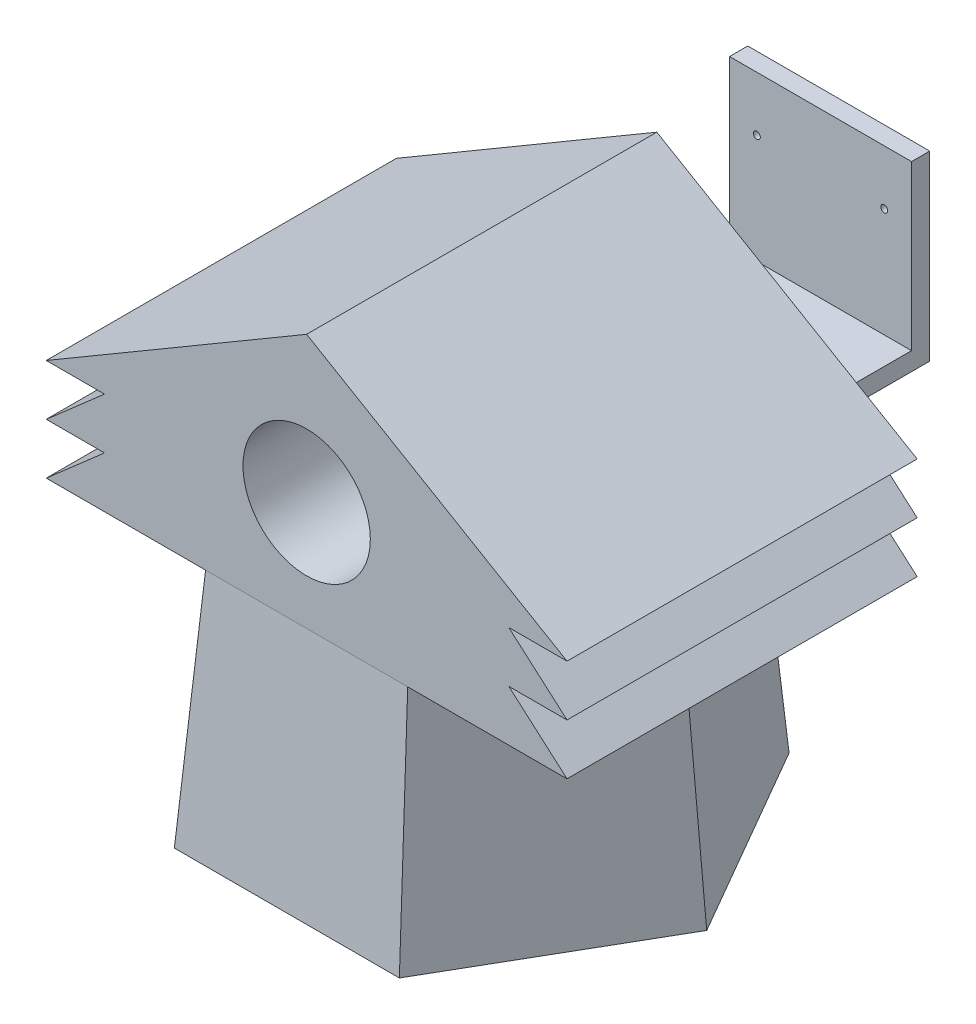
ISO-10303-21;
HEADER;
FILE_DESCRIPTION(('STEP AP214'),'2;1');
FILE_NAME('part.step','',(''),(''),'','','');
FILE_SCHEMA(('AUTOMOTIVE_DESIGN { 1 0 10303 214 1 1 1 1 }'));
ENDSEC;
DATA;
#1=APPLICATION_CONTEXT('core data for automotive mechanical design processes');
#2=APPLICATION_PROTOCOL_DEFINITION('international standard','automotive_design',2000,#1);
#3=PRODUCT_CONTEXT('',#1,'mechanical');
#4=PRODUCT('Part','Part','',(#3));
#5=PRODUCT_RELATED_PRODUCT_CATEGORY('part','',(#4));
#6=PRODUCT_DEFINITION_FORMATION('','',#4);
#7=PRODUCT_DEFINITION_CONTEXT('part definition',#1,'design');
#8=PRODUCT_DEFINITION('design','',#6,#7);
#9=PRODUCT_DEFINITION_SHAPE('','',#8);
#10=(LENGTH_UNIT() NAMED_UNIT(*) SI_UNIT(.MILLI.,.METRE.));
#11=(NAMED_UNIT(*) PLANE_ANGLE_UNIT() SI_UNIT($,.RADIAN.));
#12=(NAMED_UNIT(*) SI_UNIT($,.STERADIAN.) SOLID_ANGLE_UNIT());
#13=UNCERTAINTY_MEASURE_WITH_UNIT(LENGTH_MEASURE(1.E-05),#10,'distance_accuracy_value','');
#14=(GEOMETRIC_REPRESENTATION_CONTEXT(3) GLOBAL_UNCERTAINTY_ASSIGNED_CONTEXT((#13)) GLOBAL_UNIT_ASSIGNED_CONTEXT((#10,
#11,#12)) REPRESENTATION_CONTEXT('',''));
#15=CARTESIAN_POINT('',(0.,0.,0.));
#16=DIRECTION('',(0.,0.,1.));
#17=DIRECTION('',(1.,0.,0.));
#18=AXIS2_PLACEMENT_3D('',#15,#16,#17);
#19=CARTESIAN_POINT('',(0.,265.,0.));
#20=DIRECTION('',(0.,-1.,0.));
#21=DIRECTION('',(0.,0.,-1.));
#22=AXIS2_PLACEMENT_3D('',#19,#20,#21);
#23=PLANE('',#22);
#24=DIRECTION('',(-0.5,0.,0.866025403784439));
#25=VECTOR('',#24,1.);
#26=CARTESIAN_POINT('',(34.7077525117772,265.,20.0385302556415));
#27=LINE('',#26,#25);
#28=CARTESIAN_POINT('',(46.2770033490363,265.,-1.54114276739265E-13));
#29=VERTEX_POINT('',#28);
#30=CARTESIAN_POINT('',(23.1385016745183,265.,40.0770605112829));
#31=VERTEX_POINT('',#30);
#32=EDGE_CURVE('E457',#29,#31,#27,.T.);
#33=ORIENTED_EDGE('',*,*,#32,.T.);
#34=DIRECTION('',(-1.,0.,0.));
#35=VECTOR('',#34,1.);
#36=CARTESIAN_POINT('',(0.,265.,40.0770605112829));
#37=LINE('',#36,#35);
#38=CARTESIAN_POINT('',(-23.138501674518,265.,40.0770605112831));
#39=VERTEX_POINT('',#38);
#40=EDGE_CURVE('E471',#31,#39,#37,.T.);
#41=ORIENTED_EDGE('',*,*,#40,.T.);
#42=DIRECTION('',(-0.5,0.,-0.866025403784438));
#43=VECTOR('',#42,1.);
#44=CARTESIAN_POINT('',(-34.7077525117772,265.,20.0385302556415));
#45=LINE('',#44,#43);
#46=CARTESIAN_POINT('',(-46.2770033490363,265.,1.96695190585927E-13));
#47=VERTEX_POINT('',#46);
#48=EDGE_CURVE('E470',#39,#47,#45,.T.);
#49=ORIENTED_EDGE('',*,*,#48,.T.);
#50=DIRECTION('',(0.5,0.,-0.866025403784439));
#51=VECTOR('',#50,1.);
#52=CARTESIAN_POINT('',(-34.7077525117772,265.,-20.0385302556414));
#53=LINE('',#52,#51);
#54=CARTESIAN_POINT('',(-23.1385016745182,265.,-40.0770605112829));
#55=VERTEX_POINT('',#54);
#56=EDGE_CURVE('E379',#47,#55,#53,.T.);
#57=ORIENTED_EDGE('',*,*,#56,.T.);
#58=DIRECTION('',(1.,0.,0.));
#59=VECTOR('',#58,1.);
#60=CARTESIAN_POINT('',(0.,265.,-40.0770605112829));
#61=LINE('',#60,#59);
#62=CARTESIAN_POINT('',(23.138501674518,265.,-40.077060511283));
#63=VERTEX_POINT('',#62);
#64=EDGE_CURVE('E447',#55,#63,#61,.T.);
#65=ORIENTED_EDGE('',*,*,#64,.T.);
#66=DIRECTION('',(0.5,0.,0.866025403784438));
#67=VECTOR('',#66,1.);
#68=CARTESIAN_POINT('',(34.7077525117772,265.,-20.0385302556415));
#69=LINE('',#68,#67);
#70=EDGE_CURVE('E451',#63,#29,#69,.T.);
#71=ORIENTED_EDGE('',*,*,#70,.T.);
#72=EDGE_LOOP('',(#33,#41,#49,#57,#65,#71));
#73=FACE_BOUND('',#72,.T.);
#74=ADVANCED_FACE('F170',(#73),#23,.T.);
#75=CARTESIAN_POINT('',(-53.5265211183675,5.16901772803462,-30.9035513764736));
#76=DIRECTION('',(0.863012612721963,-0.08334050862025,0.498260564269067));
#77=DIRECTION('',(0.5,0.,-0.866025403784439));
#78=AXIS2_PLACEMENT_3D('',#75,#76,#77);
#79=PLANE('',#78);
#80=DIRECTION('',(-0.5,0.,0.866025403784439));
#81=VECTOR('',#80,1.);
#82=CARTESIAN_POINT('',(-39.4155050235543,200.,-22.7565524355941));
#83=LINE('',#82,#81);
#84=CARTESIAN_POINT('',(-26.2770033490365,200.,-45.5131048711882));
#85=VERTEX_POINT('',#84);
#86=CARTESIAN_POINT('',(-52.5540066980726,200.,3.90519791167494E-13));
#87=VERTEX_POINT('',#86);
#88=EDGE_CURVE('E12',#85,#87,#83,.T.);
#89=ORIENTED_EDGE('',*,*,#88,.F.);
#90=DIRECTION('',(0.0480610614431202,0.995369548204004,0.0832442002851681));
#91=VECTOR('',#90,1.);
#92=CARTESIAN_POINT('',(-30.3811978464837,115.,-52.6217782649107));
#93=LINE('',#92,#91);
#94=EDGE_CURVE('E381',#85,#55,#93,.T.);
#95=ORIENTED_EDGE('',*,*,#94,.T.);
#96=ORIENTED_EDGE('',*,*,#56,.F.);
#97=DIRECTION('',(0.0961221228862355,0.995369548204004,0.));
#98=VECTOR('',#97,1.);
#99=CARTESIAN_POINT('',(-60.7623956929663,115.,6.45317133063372E-13));
#100=LINE('',#99,#98);
#101=EDGE_CURVE('E371',#87,#47,#100,.T.);
#102=ORIENTED_EDGE('',*,*,#101,.F.);
#103=EDGE_LOOP('',(#89,#95,#96,#102));
#104=FACE_BOUND('',#103,.T.);
#105=ADVANCED_FACE('F377',(#104),#79,.T.);
#106=CARTESIAN_POINT('',(0.,5.16901772803463,-61.8071027529474));
#107=DIRECTION('',(0.,-0.0833405086202501,0.996521128538135));
#108=DIRECTION('',(0.,-0.996521128538135,-0.0833405086202501));
#109=AXIS2_PLACEMENT_3D('',#106,#107,#108);
#110=PLANE('',#109);
#111=DIRECTION('',(-1.,0.,0.));
#112=VECTOR('',#111,1.);
#113=CARTESIAN_POINT('',(0.,200.,-45.5131048711883));
#114=LINE('',#113,#112);
#115=CARTESIAN_POINT('',(26.277003349036,200.,-45.5131048711885));
#116=VERTEX_POINT('',#115);
#117=EDGE_CURVE('E195',#116,#85,#114,.T.);
#118=ORIENTED_EDGE('',*,*,#117,.F.);
#119=DIRECTION('',(-0.0480610614431154,0.995369548204004,0.0832442002851709));
#120=VECTOR('',#119,1.);
#121=CARTESIAN_POINT('',(30.3811978464826,115.,-52.6217782649113));
#122=LINE('',#121,#120);
#123=EDGE_CURVE('E384',#116,#63,#122,.T.);
#124=ORIENTED_EDGE('',*,*,#123,.T.);
#125=ORIENTED_EDGE('',*,*,#64,.F.);
#126=ORIENTED_EDGE('',*,*,#94,.F.);
#127=EDGE_LOOP('',(#118,#124,#125,#126));
#128=FACE_BOUND('',#127,.T.);
#129=ADVANCED_FACE('F445',(#128),#110,.T.);
#130=CARTESIAN_POINT('',(53.5265211183675,5.16901772803463,-30.9035513764737));
#131=DIRECTION('',(-0.863012612721963,-0.0833405086202501,0.498260564269068));
#132=DIRECTION('',(0.5,0.,0.866025403784438));
#133=AXIS2_PLACEMENT_3D('',#130,#131,#132);
#134=PLANE('',#133);
#135=DIRECTION('',(-0.5,0.,-0.866025403784438));
#136=VECTOR('',#135,1.);
#137=CARTESIAN_POINT('',(39.4155050235543,200.,-22.7565524355942));
#138=LINE('',#137,#136);
#139=CARTESIAN_POINT('',(52.5540066980725,200.,-2.95675747812406E-13));
#140=VERTEX_POINT('',#139);
#141=EDGE_CURVE('E953',#140,#116,#138,.T.);
#142=ORIENTED_EDGE('',*,*,#141,.F.);
#143=DIRECTION('',(-0.0961221228862355,0.995369548204004,0.));
#144=VECTOR('',#143,1.);
#145=CARTESIAN_POINT('',(60.7623956929663,115.,-6.34393653578018E-13));
#146=LINE('',#145,#144);
#147=EDGE_CURVE('E439',#140,#29,#146,.T.);
#148=ORIENTED_EDGE('',*,*,#147,.T.);
#149=ORIENTED_EDGE('',*,*,#70,.F.);
#150=ORIENTED_EDGE('',*,*,#123,.F.);
#151=EDGE_LOOP('',(#142,#148,#149,#150));
#152=FACE_BOUND('',#151,.T.);
#153=ADVANCED_FACE('F452',(#152),#134,.T.);
#154=CARTESIAN_POINT('',(53.5265211183675,5.16901772803463,30.9035513764737));
#155=DIRECTION('',(-0.863012612721963,-0.0833405086202501,-0.498260564269067));
#156=DIRECTION('',(-0.5,0.,0.866025403784439));
#157=AXIS2_PLACEMENT_3D('',#154,#155,#156);
#158=PLANE('',#157);
#159=DIRECTION('',(0.5,0.,-0.866025403784439));
#160=VECTOR('',#159,1.);
#161=CARTESIAN_POINT('',(39.4155050235544,200.,22.7565524355941));
#162=LINE('',#161,#160);
#163=CARTESIAN_POINT('',(26.2770033490365,200.,45.5131048711882));
#164=VERTEX_POINT('',#163);
#165=EDGE_CURVE('E375',#164,#140,#162,.T.);
#166=ORIENTED_EDGE('',*,*,#165,.F.);
#167=DIRECTION('',(-0.0480610614431203,0.995369548204004,-0.0832442002851682));
#168=VECTOR('',#167,1.);
#169=CARTESIAN_POINT('',(30.3811978464837,115.,52.6217782649107));
#170=LINE('',#169,#168);
#171=EDGE_CURVE('E405',#164,#31,#170,.T.);
#172=ORIENTED_EDGE('',*,*,#171,.T.);
#173=ORIENTED_EDGE('',*,*,#32,.F.);
#174=ORIENTED_EDGE('',*,*,#147,.F.);
#175=EDGE_LOOP('',(#166,#172,#173,#174));
#176=FACE_BOUND('',#175,.T.);
#177=ADVANCED_FACE('F738',(#176),#158,.T.);
#178=CARTESIAN_POINT('',(-53.5265211183675,5.16901772803463,30.9035513764737));
#179=DIRECTION('',(0.863012612721963,-0.0833405086202502,-0.498260564269068));
#180=DIRECTION('',(-0.5,0.,-0.866025403784438));
#181=AXIS2_PLACEMENT_3D('',#178,#179,#180);
#182=PLANE('',#181);
#183=DIRECTION('',(0.5,0.,0.866025403784438));
#184=VECTOR('',#183,1.);
#185=CARTESIAN_POINT('',(-39.4155050235543,200.,22.7565524355942));
#186=LINE('',#185,#184);
#187=CARTESIAN_POINT('',(-26.277003349036,200.,45.5131048711887));
#188=VERTEX_POINT('',#187);
#189=EDGE_CURVE('E362',#87,#188,#186,.T.);
#190=ORIENTED_EDGE('',*,*,#189,.F.);
#191=ORIENTED_EDGE('',*,*,#101,.T.);
#192=ORIENTED_EDGE('',*,*,#48,.F.);
#193=DIRECTION('',(0.0480610614431152,0.995369548204004,-0.0832442002851711));
#194=VECTOR('',#193,1.);
#195=CARTESIAN_POINT('',(-30.3811978464826,115.,52.6217782649113));
#196=LINE('',#195,#194);
#197=EDGE_CURVE('E373',#188,#39,#196,.T.);
#198=ORIENTED_EDGE('',*,*,#197,.F.);
#199=EDGE_LOOP('',(#190,#191,#192,#198));
#200=FACE_BOUND('',#199,.T.);
#201=ADVANCED_FACE('F369',(#200),#182,.T.);
#202=CARTESIAN_POINT('',(0.,5.16901772803463,61.8071027529474));
#203=DIRECTION('',(0.,-0.0833405086202502,-0.996521128538135));
#204=DIRECTION('',(0.,0.996521128538135,-0.0833405086202502));
#205=AXIS2_PLACEMENT_3D('',#202,#203,#204);
#206=PLANE('',#205);
#207=DIRECTION('',(1.,0.,0.));
#208=VECTOR('',#207,1.);
#209=CARTESIAN_POINT('',(0.,200.,45.5131048711883));
#210=LINE('',#209,#208);
#211=EDGE_CURVE('E374',#188,#164,#210,.T.);
#212=ORIENTED_EDGE('',*,*,#211,.F.);
#213=ORIENTED_EDGE('',*,*,#197,.T.);
#214=ORIENTED_EDGE('',*,*,#40,.F.);
#215=ORIENTED_EDGE('',*,*,#171,.F.);
#216=EDGE_LOOP('',(#212,#213,#214,#215));
#217=FACE_BOUND('',#216,.T.);
#218=ADVANCED_FACE('F744',(#217),#206,.T.);
#219=CARTESIAN_POINT('',(-101.551779300102,200.,-98.1049886413525));
#220=DIRECTION('',(0.,1.,0.));
#221=DIRECTION('',(0.,0.,1.));
#222=AXIS2_PLACEMENT_3D('',#219,#220,#221);
#223=PLANE('',#222);
#224=ORIENTED_EDGE('',*,*,#211,.T.);
#225=ORIENTED_EDGE('',*,*,#165,.T.);
#226=ORIENTED_EDGE('',*,*,#141,.T.);
#227=ORIENTED_EDGE('',*,*,#117,.T.);
#228=ORIENTED_EDGE('',*,*,#88,.T.);
#229=ORIENTED_EDGE('',*,*,#189,.T.);
#230=EDGE_LOOP('',(#224,#225,#226,#227,#228,#229));
#231=FACE_BOUND('',#230,.T.);
#232=DIRECTION('',(0.5,0.,0.866025403784438));
#233=VECTOR('',#232,1.);
#234=CARTESIAN_POINT('',(-46.3678947239503,200.,26.770516500629));
#235=LINE('',#234,#233);
#236=CARTESIAN_POINT('',(-61.8238596319338,200.,0.));
#237=VERTEX_POINT('',#236);
#238=CARTESIAN_POINT('',(-30.9119298159669,200.,53.5410330012579));
#239=VERTEX_POINT('',#238);
#240=EDGE_CURVE('E188',#237,#239,#235,.T.);
#241=ORIENTED_EDGE('',*,*,#240,.F.);
#242=DIRECTION('',(-0.5,0.,0.866025403784439));
#243=VECTOR('',#242,1.);
#244=CARTESIAN_POINT('',(-46.3678947239503,200.,-26.7705165006289));
#245=LINE('',#244,#243);
#246=CARTESIAN_POINT('',(-30.9119298159669,200.,-53.5410330012579));
#247=VERTEX_POINT('',#246);
#248=EDGE_CURVE('E630',#247,#237,#245,.T.);
#249=ORIENTED_EDGE('',*,*,#248,.F.);
#250=DIRECTION('',(-1.,0.,0.));
#251=VECTOR('',#250,1.);
#252=CARTESIAN_POINT('',(0.,200.,-53.5410330012579));
#253=LINE('',#252,#251);
#254=CARTESIAN_POINT('',(30.9119298159669,200.,-53.5410330012579));
#255=VERTEX_POINT('',#254);
#256=EDGE_CURVE('E629',#255,#247,#253,.T.);
#257=ORIENTED_EDGE('',*,*,#256,.F.);
#258=DIRECTION('',(-0.5,0.,-0.866025403784438));
#259=VECTOR('',#258,1.);
#260=CARTESIAN_POINT('',(46.3678947239503,200.,-26.770516500629));
#261=LINE('',#260,#259);
#262=CARTESIAN_POINT('',(61.8238596319338,200.,0.));
#263=VERTEX_POINT('',#262);
#264=EDGE_CURVE('E621',#263,#255,#261,.T.);
#265=ORIENTED_EDGE('',*,*,#264,.F.);
#266=DIRECTION('',(0.5,0.,-0.866025403784439));
#267=VECTOR('',#266,1.);
#268=CARTESIAN_POINT('',(46.3678947239503,200.,26.770516500629));
#269=LINE('',#268,#267);
#270=CARTESIAN_POINT('',(30.9119298159669,200.,53.5410330012579));
#271=VERTEX_POINT('',#270);
#272=EDGE_CURVE('E636',#271,#263,#269,.T.);
#273=ORIENTED_EDGE('',*,*,#272,.F.);
#274=DIRECTION('',(1.,0.,0.));
#275=VECTOR('',#274,1.);
#276=CARTESIAN_POINT('',(0.,200.,53.5410330012579));
#277=LINE('',#276,#275);
#278=EDGE_CURVE('E639',#239,#271,#277,.T.);
#279=ORIENTED_EDGE('',*,*,#278,.F.);
#280=EDGE_LOOP('',(#241,#249,#257,#265,#273,#279));
#281=FACE_BOUND('',#280,.T.);
#282=ADVANCED_FACE('F361',(#231,#281),#223,.F.);
#283=CARTESIAN_POINT('',(25.,273.,-98.1049886413525));
#284=DIRECTION('',(0.,-1.,0.));
#285=DIRECTION('',(0.,0.,-1.));
#286=AXIS2_PLACEMENT_3D('',#283,#284,#285);
#287=PLANE('',#286);
#288=DIRECTION('',(1.,0.,0.));
#289=VECTOR('',#288,1.);
#290=CARTESIAN_POINT('',(25.,273.,-93.1049886413525));
#291=LINE('',#290,#289);
#292=CARTESIAN_POINT('',(-25.,273.,-93.1049886413525));
#293=VERTEX_POINT('',#292);
#294=CARTESIAN_POINT('',(25.,273.,-93.1049886413525));
#295=VERTEX_POINT('',#294);
#296=EDGE_CURVE('E641',#293,#295,#291,.T.);
#297=ORIENTED_EDGE('',*,*,#296,.F.);
#298=DIRECTION('',(0.,0.,1.));
#299=VECTOR('',#298,1.);
#300=CARTESIAN_POINT('',(-25.,273.,-98.1049886413525));
#301=LINE('',#300,#299);
#302=CARTESIAN_POINT('',(-25.,273.,-48.1049886413525));
#303=VERTEX_POINT('',#302);
#304=EDGE_CURVE('E679',#293,#303,#301,.T.);
#305=ORIENTED_EDGE('',*,*,#304,.T.);
#306=DIRECTION('',(1.,0.,0.));
#307=VECTOR('',#306,1.);
#308=CARTESIAN_POINT('',(25.,273.,-48.1049886413525));
#309=LINE('',#308,#307);
#310=CARTESIAN_POINT('',(25.,273.,-48.1049886413525));
#311=VERTEX_POINT('',#310);
#312=EDGE_CURVE('E663',#303,#311,#309,.T.);
#313=ORIENTED_EDGE('',*,*,#312,.T.);
#314=DIRECTION('',(0.,0.,1.));
#315=VECTOR('',#314,1.);
#316=CARTESIAN_POINT('',(25.,273.,-98.1049886413525));
#317=LINE('',#316,#315);
#318=EDGE_CURVE('E667',#295,#311,#317,.T.);
#319=ORIENTED_EDGE('',*,*,#318,.F.);
#320=EDGE_LOOP('',(#297,#305,#313,#319));
#321=FACE_BOUND('',#320,.T.);
#322=ADVANCED_FACE('F749',(#321),#287,.F.);
#323=CARTESIAN_POINT('',(71.5468562828976,335.,-48.1049886413525));
#324=DIRECTION('',(0.,0.,1.));
#325=DIRECTION('',(1.,0.,0.));
#326=AXIS2_PLACEMENT_3D('',#323,#324,#325);
#327=PLANE('',#326);
#328=DIRECTION('',(-0.752576694706879,-0.658504607868517,0.));
#329=VECTOR('',#328,1.);
#330=CARTESIAN_POINT('',(44.1876357897655,366.26768056358,-48.1049886413525));
#331=LINE('',#330,#329);
#332=CARTESIAN_POINT('',(-55.5468562828975,279.,-48.1049886413525));
#333=VERTEX_POINT('',#332);
#334=CARTESIAN_POINT('',(-71.5468562828976,265.,-48.1049886413525));
#335=VERTEX_POINT('',#334);
#336=EDGE_CURVE('E507',#333,#335,#331,.T.);
#337=ORIENTED_EDGE('',*,*,#336,.F.);
#338=DIRECTION('',(1.,0.,0.));
#339=VECTOR('',#338,1.);
#340=CARTESIAN_POINT('',(71.5468562828976,279.,-48.1049886413525));
#341=LINE('',#340,#339);
#342=CARTESIAN_POINT('',(-71.5468562828975,279.,-48.1049886413525));
#343=VERTEX_POINT('',#342);
#344=EDGE_CURVE('E505',#343,#333,#341,.T.);
#345=ORIENTED_EDGE('',*,*,#344,.F.);
#346=DIRECTION('',(-0.752576694706879,-0.658504607868517,0.));
#347=VECTOR('',#346,1.);
#348=CARTESIAN_POINT('',(37.2495826924202,374.196884103403,-48.1049886413525));
#349=LINE('',#348,#347);
#350=CARTESIAN_POINT('',(-55.5468562828976,293.,-48.1049886413525));
#351=VERTEX_POINT('',#350);
#352=EDGE_CURVE('E180',#351,#343,#349,.T.);
#353=ORIENTED_EDGE('',*,*,#352,.F.);
#354=DIRECTION('',(1.,0.,0.));
#355=VECTOR('',#354,1.);
#356=CARTESIAN_POINT('',(71.5468562828976,293.,-48.1049886413525));
#357=LINE('',#356,#355);
#358=CARTESIAN_POINT('',(-71.5468562828976,293.,-48.1049886413525));
#359=VERTEX_POINT('',#358);
#360=EDGE_CURVE('E504',#359,#351,#357,.T.);
#361=ORIENTED_EDGE('',*,*,#360,.F.);
#362=DIRECTION('',(-0.862388914267258,-0.506246343738836,0.));
#363=VECTOR('',#362,1.);
#364=CARTESIAN_POINT('',(53.210444424292,366.236014856945,-48.1049886413525));
#365=LINE('',#364,#363);
#366=CARTESIAN_POINT('',(0.,335.,-48.1049886413525));
#367=VERTEX_POINT('',#366);
#368=EDGE_CURVE('E418',#367,#359,#365,.T.);
#369=ORIENTED_EDGE('',*,*,#368,.F.);
#370=DIRECTION('',(0.862388914267258,-0.506246343738836,0.));
#371=VECTOR('',#370,1.);
#372=CARTESIAN_POINT('',(53.210444424292,303.763985143055,-48.1049886413525));
#373=LINE('',#372,#371);
#374=CARTESIAN_POINT('',(71.5468562828976,293.,-48.1049886413525));
#375=VERTEX_POINT('',#374);
#376=EDGE_CURVE('E561',#367,#375,#373,.T.);
#377=ORIENTED_EDGE('',*,*,#376,.T.);
#378=DIRECTION('',(-1.,0.,0.));
#379=VECTOR('',#378,1.);
#380=CARTESIAN_POINT('',(71.5468562828976,293.,-48.1049886413525));
#381=LINE('',#380,#379);
#382=CARTESIAN_POINT('',(55.5468562828976,293.,-48.1049886413525));
#383=VERTEX_POINT('',#382);
#384=EDGE_CURVE('E549',#375,#383,#381,.T.);
#385=ORIENTED_EDGE('',*,*,#384,.T.);
#386=DIRECTION('',(0.752576694706879,-0.658504607868517,0.));
#387=VECTOR('',#386,1.);
#388=CARTESIAN_POINT('',(43.7946438935171,303.283185840708,-48.1049886413525));
#389=LINE('',#388,#387);
#390=CARTESIAN_POINT('',(71.5468562828976,279.,-48.1049886413525));
#391=VERTEX_POINT('',#390);
#392=EDGE_CURVE('E553',#383,#391,#389,.T.);
#393=ORIENTED_EDGE('',*,*,#392,.T.);
#394=DIRECTION('',(-1.,0.,0.));
#395=VECTOR('',#394,1.);
#396=CARTESIAN_POINT('',(71.5468562828976,279.,-48.1049886413525));
#397=LINE('',#396,#395);
#398=CARTESIAN_POINT('',(55.5468562828975,279.,-48.1049886413525));
#399=VERTEX_POINT('',#398);
#400=EDGE_CURVE('E532',#391,#399,#397,.T.);
#401=ORIENTED_EDGE('',*,*,#400,.T.);
#402=DIRECTION('',(0.75257669470688,-0.658504607868516,0.));
#403=VECTOR('',#402,1.);
#404=CARTESIAN_POINT('',(36.8565907961719,295.353982300885,-48.1049886413525));
#405=LINE('',#404,#403);
#406=CARTESIAN_POINT('',(71.5468562828976,265.,-48.1049886413525));
#407=VERTEX_POINT('',#406);
#408=EDGE_CURVE('E537',#399,#407,#405,.T.);
#409=ORIENTED_EDGE('',*,*,#408,.T.);
#410=DIRECTION('',(-1.,0.,0.));
#411=VECTOR('',#410,1.);
#412=CARTESIAN_POINT('',(71.5468562828976,265.,-48.1049886413525));
#413=LINE('',#412,#411);
#414=CARTESIAN_POINT('',(27.7734281414488,265.,-48.1049886413525));
#415=VERTEX_POINT('',#414);
#416=EDGE_CURVE('E578',#407,#415,#413,.T.);
#417=ORIENTED_EDGE('',*,*,#416,.T.);
#418=DIRECTION('',(1.,0.,0.));
#419=VECTOR('',#418,1.);
#420=CARTESIAN_POINT('',(0.,265.,-48.1049886413525));
#421=LINE('',#420,#419);
#422=CARTESIAN_POINT('',(-27.7734281414488,265.,-48.1049886413525));
#423=VERTEX_POINT('',#422);
#424=EDGE_CURVE('E476',#423,#415,#421,.T.);
#425=ORIENTED_EDGE('',*,*,#424,.F.);
#426=EDGE_CURVE('E465',#423,#335,#413,.T.);
#427=ORIENTED_EDGE('',*,*,#426,.T.);
#428=EDGE_LOOP('',(#337,#345,#353,#361,#369,#377,#385,#393,#401,#409,#417,#425,#427));
#429=FACE_BOUND('',#428,.T.);
#430=CARTESIAN_POINT('',(0.,295.,-48.1049886413525));
#431=DIRECTION('',(0.,0.,1.));
#432=DIRECTION('',(1.,0.,0.));
#433=AXIS2_PLACEMENT_3D('',#430,#431,#432);
#434=CIRCLE('',#433,17.5);
#435=CARTESIAN_POINT('',(17.5,295.,-48.1049886413525));
#436=VERTEX_POINT('',#435);
#437=EDGE_CURVE('E391',#436,#436,#434,.T.);
#438=ORIENTED_EDGE('',*,*,#437,.T.);
#439=EDGE_LOOP('',(#438));
#440=FACE_BOUND('',#439,.T.);
#441=DIRECTION('',(0.,-1.,0.));
#442=VECTOR('',#441,1.);
#443=CARTESIAN_POINT('',(25.,273.,-48.1049886413525));
#444=LINE('',#443,#442);
#445=CARTESIAN_POINT('',(25.,268.,-48.1049886413525));
#446=VERTEX_POINT('',#445);
#447=EDGE_CURVE('E658',#311,#446,#444,.T.);
#448=ORIENTED_EDGE('',*,*,#447,.F.);
#449=ORIENTED_EDGE('',*,*,#312,.F.);
#450=DIRECTION('',(0.,1.,0.));
#451=VECTOR('',#450,1.);
#452=CARTESIAN_POINT('',(-25.,273.,-48.1049886413525));
#453=LINE('',#452,#451);
#454=CARTESIAN_POINT('',(-25.,268.,-48.1049886413525));
#455=VERTEX_POINT('',#454);
#456=EDGE_CURVE('E673',#455,#303,#453,.T.);
#457=ORIENTED_EDGE('',*,*,#456,.F.);
#458=DIRECTION('',(-1.,0.,0.));
#459=VECTOR('',#458,1.);
#460=CARTESIAN_POINT('',(25.,268.,-48.1049886413525));
#461=LINE('',#460,#459);
#462=EDGE_CURVE('E670',#446,#455,#461,.T.);
#463=ORIENTED_EDGE('',*,*,#462,.F.);
#464=EDGE_LOOP('',(#448,#449,#457,#463));
#465=FACE_BOUND('',#464,.T.);
#466=ADVANCED_FACE('F501',(#429,#440,#465),#327,.F.);
#467=CARTESIAN_POINT('',(71.5468562828976,335.,48.1049886413525));
#468=DIRECTION('',(0.,0.,-1.));
#469=DIRECTION('',(-1.,0.,0.));
#470=AXIS2_PLACEMENT_3D('',#467,#468,#469);
#471=PLANE('',#470);
#472=CARTESIAN_POINT('',(0.,295.,48.1049886413525));
#473=DIRECTION('',(0.,0.,1.));
#474=DIRECTION('',(1.,0.,0.));
#475=AXIS2_PLACEMENT_3D('',#472,#473,#474);
#476=CIRCLE('',#475,17.5);
#477=CARTESIAN_POINT('',(17.5,295.,48.1049886413525));
#478=VERTEX_POINT('',#477);
#479=EDGE_CURVE('E687',#478,#478,#476,.T.);
#480=ORIENTED_EDGE('',*,*,#479,.F.);
#481=EDGE_LOOP('',(#480));
#482=FACE_BOUND('',#481,.T.);
#483=DIRECTION('',(-0.752576694706879,-0.658504607868517,0.));
#484=VECTOR('',#483,1.);
#485=CARTESIAN_POINT('',(-162.352176618247,185.545344706569,48.1049886413525));
#486=LINE('',#485,#484);
#487=CARTESIAN_POINT('',(-55.5468562828975,279.,48.1049886413525));
#488=VERTEX_POINT('',#487);
#489=CARTESIAN_POINT('',(-71.5468562828974,265.,48.1049886413525));
#490=VERTEX_POINT('',#489);
#491=EDGE_CURVE('E518',#488,#490,#486,.T.);
#492=ORIENTED_EDGE('',*,*,#491,.T.);
#493=DIRECTION('',(1.,0.,0.));
#494=VECTOR('',#493,1.);
#495=CARTESIAN_POINT('',(71.5468562828976,265.,48.1049886413525));
#496=LINE('',#495,#494);
#497=CARTESIAN_POINT('',(-27.7734281414487,265.,48.1049886413525));
#498=VERTEX_POINT('',#497);
#499=EDGE_CURVE('E459',#490,#498,#496,.T.);
#500=ORIENTED_EDGE('',*,*,#499,.T.);
#501=DIRECTION('',(-1.,0.,0.));
#502=VECTOR('',#501,1.);
#503=CARTESIAN_POINT('',(0.,265.,48.1049886413525));
#504=LINE('',#503,#502);
#505=CARTESIAN_POINT('',(27.7734281414488,265.,48.1049886413525));
#506=VERTEX_POINT('',#505);
#507=EDGE_CURVE('E382',#506,#498,#504,.T.);
#508=ORIENTED_EDGE('',*,*,#507,.F.);
#509=CARTESIAN_POINT('',(71.5468562828976,265.,48.1049886413525));
#510=VERTEX_POINT('',#509);
#511=EDGE_CURVE('E462',#506,#510,#496,.T.);
#512=ORIENTED_EDGE('',*,*,#511,.T.);
#513=DIRECTION('',(0.75257669470688,-0.658504607868516,0.));
#514=VECTOR('',#513,1.);
#515=CARTESIAN_POINT('',(162.352176618247,185.545344706569,48.1049886413525));
#516=LINE('',#515,#514);
#517=CARTESIAN_POINT('',(55.5468562828975,279.,48.1049886413525));
#518=VERTEX_POINT('',#517);
#519=EDGE_CURVE('E530',#518,#510,#516,.T.);
#520=ORIENTED_EDGE('',*,*,#519,.F.);
#521=DIRECTION('',(-1.,0.,0.));
#522=VECTOR('',#521,1.);
#523=CARTESIAN_POINT('',(0.,279.,48.1049886413525));
#524=LINE('',#523,#522);
#525=CARTESIAN_POINT('',(71.5468562828976,279.,48.1049886413525));
#526=VERTEX_POINT('',#525);
#527=EDGE_CURVE('E529',#526,#518,#524,.T.);
#528=ORIENTED_EDGE('',*,*,#527,.F.);
#529=DIRECTION('',(0.752576694706879,-0.658504607868517,0.));
#530=VECTOR('',#529,1.);
#531=CARTESIAN_POINT('',(169.290229715593,193.474548246392,48.1049886413525));
#532=LINE('',#531,#530);
#533=CARTESIAN_POINT('',(55.5468562828976,293.,48.1049886413525));
#534=VERTEX_POINT('',#533);
#535=EDGE_CURVE('E543',#534,#526,#532,.T.);
#536=ORIENTED_EDGE('',*,*,#535,.F.);
#537=DIRECTION('',(-1.,0.,0.));
#538=VECTOR('',#537,1.);
#539=CARTESIAN_POINT('',(0.,293.,48.1049886413525));
#540=LINE('',#539,#538);
#541=CARTESIAN_POINT('',(71.5468562828976,293.,48.1049886413525));
#542=VERTEX_POINT('',#541);
#543=EDGE_CURVE('E540',#542,#534,#540,.T.);
#544=ORIENTED_EDGE('',*,*,#543,.F.);
#545=DIRECTION('',(0.862388914267258,-0.506246343738836,0.));
#546=VECTOR('',#545,1.);
#547=CARTESIAN_POINT('',(146.254713634116,249.144404216105,48.1049886413525));
#548=LINE('',#547,#546);
#549=CARTESIAN_POINT('',(0.,335.,48.1049886413525));
#550=VERTEX_POINT('',#549);
#551=EDGE_CURVE('E558',#550,#542,#548,.T.);
#552=ORIENTED_EDGE('',*,*,#551,.F.);
#553=DIRECTION('',(-0.862388914267258,-0.506246343738836,0.));
#554=VECTOR('',#553,1.);
#555=CARTESIAN_POINT('',(-146.254713634116,249.144404216105,48.1049886413525));
#556=LINE('',#555,#554);
#557=CARTESIAN_POINT('',(-71.5468562828976,293.,48.1049886413525));
#558=VERTEX_POINT('',#557);
#559=EDGE_CURVE('E564',#550,#558,#556,.T.);
#560=ORIENTED_EDGE('',*,*,#559,.T.);
#561=DIRECTION('',(1.,0.,0.));
#562=VECTOR('',#561,1.);
#563=CARTESIAN_POINT('',(0.,293.,48.1049886413525));
#564=LINE('',#563,#562);
#565=CARTESIAN_POINT('',(-55.5468562828976,293.,48.1049886413525));
#566=VERTEX_POINT('',#565);
#567=EDGE_CURVE('E521',#558,#566,#564,.T.);
#568=ORIENTED_EDGE('',*,*,#567,.T.);
#569=DIRECTION('',(-0.752576694706879,-0.658504607868517,0.));
#570=VECTOR('',#569,1.);
#571=CARTESIAN_POINT('',(-169.290229715593,193.474548246392,48.1049886413525));
#572=LINE('',#571,#570);
#573=CARTESIAN_POINT('',(-71.5468562828975,279.,48.1049886413525));
#574=VERTEX_POINT('',#573);
#575=EDGE_CURVE('E512',#566,#574,#572,.T.);
#576=ORIENTED_EDGE('',*,*,#575,.T.);
#577=DIRECTION('',(1.,0.,0.));
#578=VECTOR('',#577,1.);
#579=CARTESIAN_POINT('',(0.,279.,48.1049886413525));
#580=LINE('',#579,#578);
#581=EDGE_CURVE('E510',#574,#488,#580,.T.);
#582=ORIENTED_EDGE('',*,*,#581,.T.);
#583=EDGE_LOOP('',(#492,#500,#508,#512,#520,#528,#536,#544,#552,#560,#568,#576,#582));
#584=FACE_BOUND('',#583,.T.);
#585=ADVANCED_FACE('F597',(#482,#584),#471,.F.);
#586=CARTESIAN_POINT('',(0.,5.83574179699663,69.7792717812525));
#587=DIRECTION('',(0.,-0.0833405086202502,-0.996521128538135));
#588=DIRECTION('',(0.,0.996521128538135,-0.0833405086202502));
#589=AXIS2_PLACEMENT_3D('',#586,#587,#588);
#590=PLANE('',#589);
#591=DIRECTION('',(0.0480610614431169,0.995369548204004,-0.0832442002851682));
#592=VECTOR('',#591,1.);
#593=CARTESIAN_POINT('',(-40.1940236023455,7.76301602348197,69.6180910398851));
#594=LINE('',#593,#592);
#595=EDGE_CURVE('E174',#239,#498,#594,.T.);
#596=ORIENTED_EDGE('',*,*,#595,.F.);
#597=ORIENTED_EDGE('',*,*,#278,.T.);
#598=DIRECTION('',(-0.0480610614431169,0.995369548204004,-0.0832442002851682));
#599=VECTOR('',#598,1.);
#600=CARTESIAN_POINT('',(40.1940236023456,7.76301602348197,69.6180910398851));
#601=LINE('',#600,#599);
#602=EDGE_CURVE('E606',#271,#506,#601,.T.);
#603=ORIENTED_EDGE('',*,*,#602,.T.);
#604=ORIENTED_EDGE('',*,*,#507,.T.);
#605=EDGE_LOOP('',(#596,#597,#603,#604));
#606=FACE_BOUND('',#605,.T.);
#607=ADVANCED_FACE('F731',(#606),#590,.F.);
#608=CARTESIAN_POINT('',(-60.4306220201432,5.83574179699663,34.8896358906263));
#609=DIRECTION('',(0.863012612721963,-0.0833405086202502,-0.498260564269068));
#610=DIRECTION('',(-0.5,0.,-0.866025403784438));
#611=AXIS2_PLACEMENT_3D('',#608,#609,#610);
#612=PLANE('',#611);
#613=DIRECTION('',(0.0961221228862338,0.995369548204004,0.));
#614=VECTOR('',#613,1.);
#615=CARTESIAN_POINT('',(-80.3880472046911,7.76301602348196,0.));
#616=LINE('',#615,#614);
#617=CARTESIAN_POINT('',(-55.5468562828976,265.,0.));
#618=VERTEX_POINT('',#617);
#619=EDGE_CURVE('E400',#237,#618,#616,.T.);
#620=ORIENTED_EDGE('',*,*,#619,.F.);
#621=ORIENTED_EDGE('',*,*,#240,.T.);
#622=ORIENTED_EDGE('',*,*,#595,.T.);
#623=DIRECTION('',(-0.5,0.,-0.866025403784438));
#624=VECTOR('',#623,1.);
#625=CARTESIAN_POINT('',(-41.6601422121731,265.,24.0524943206763));
#626=LINE('',#625,#624);
#627=EDGE_CURVE('E387',#498,#618,#626,.T.);
#628=ORIENTED_EDGE('',*,*,#627,.T.);
#629=EDGE_LOOP('',(#620,#621,#622,#628));
#630=FACE_BOUND('',#629,.T.);
#631=ADVANCED_FACE('F602',(#630),#612,.F.);
#632=CARTESIAN_POINT('',(60.4306220201432,5.83574179699663,34.8896358906262));
#633=DIRECTION('',(-0.863012612721963,-0.0833405086202501,-0.498260564269067));
#634=DIRECTION('',(-0.5,0.,0.866025403784439));
#635=AXIS2_PLACEMENT_3D('',#632,#633,#634);
#636=PLANE('',#635);
#637=ORIENTED_EDGE('',*,*,#602,.F.);
#638=ORIENTED_EDGE('',*,*,#272,.T.);
#639=DIRECTION('',(-0.0961221228862339,0.995369548204004,0.));
#640=VECTOR('',#639,1.);
#641=CARTESIAN_POINT('',(80.3880472046911,7.76301602348196,0.));
#642=LINE('',#641,#640);
#643=CARTESIAN_POINT('',(55.5468562828976,265.,0.));
#644=VERTEX_POINT('',#643);
#645=EDGE_CURVE('E607',#263,#644,#642,.T.);
#646=ORIENTED_EDGE('',*,*,#645,.T.);
#647=DIRECTION('',(-0.5,0.,0.866025403784439));
#648=VECTOR('',#647,1.);
#649=CARTESIAN_POINT('',(41.6601422121732,265.,24.0524943206763));
#650=LINE('',#649,#648);
#651=EDGE_CURVE('E421',#644,#506,#650,.T.);
#652=ORIENTED_EDGE('',*,*,#651,.T.);
#653=EDGE_LOOP('',(#637,#638,#646,#652));
#654=FACE_BOUND('',#653,.T.);
#655=ADVANCED_FACE('F724',(#654),#636,.F.);
#656=CARTESIAN_POINT('',(60.4306220201432,5.83574179699663,-34.8896358906262));
#657=DIRECTION('',(-0.863012612721963,-0.0833405086202501,0.498260564269068));
#658=DIRECTION('',(0.5,0.,0.866025403784438));
#659=AXIS2_PLACEMENT_3D('',#656,#657,#658);
#660=PLANE('',#659);
#661=ORIENTED_EDGE('',*,*,#645,.F.);
#662=ORIENTED_EDGE('',*,*,#264,.T.);
#663=DIRECTION('',(-0.0480610614431169,0.995369548204004,0.0832442002851682));
#664=VECTOR('',#663,1.);
#665=CARTESIAN_POINT('',(40.1940236023455,7.76301602348197,-69.6180910398851));
#666=LINE('',#665,#664);
#667=EDGE_CURVE('E411',#255,#415,#666,.T.);
#668=ORIENTED_EDGE('',*,*,#667,.T.);
#669=DIRECTION('',(0.5,0.,0.866025403784438));
#670=VECTOR('',#669,1.);
#671=CARTESIAN_POINT('',(41.6601422121731,265.,-24.0524943206763));
#672=LINE('',#671,#670);
#673=EDGE_CURVE('E429',#415,#644,#672,.T.);
#674=ORIENTED_EDGE('',*,*,#673,.T.);
#675=EDGE_LOOP('',(#661,#662,#668,#674));
#676=FACE_BOUND('',#675,.T.);
#677=ADVANCED_FACE('F620',(#676),#660,.F.);
#678=CARTESIAN_POINT('',(0.,5.83574179699663,-69.7792717812525));
#679=DIRECTION('',(0.,-0.0833405086202501,0.996521128538135));
#680=DIRECTION('',(0.,-0.996521128538135,-0.0833405086202501));
#681=AXIS2_PLACEMENT_3D('',#678,#679,#680);
#682=PLANE('',#681);
#683=ORIENTED_EDGE('',*,*,#667,.F.);
#684=ORIENTED_EDGE('',*,*,#256,.T.);
#685=DIRECTION('',(0.0480610614431168,0.995369548204004,0.0832442002851681));
#686=VECTOR('',#685,1.);
#687=CARTESIAN_POINT('',(-40.1940236023455,7.76301602348196,-69.6180910398851));
#688=LINE('',#687,#686);
#689=EDGE_CURVE('E408',#247,#423,#688,.T.);
#690=ORIENTED_EDGE('',*,*,#689,.T.);
#691=ORIENTED_EDGE('',*,*,#424,.T.);
#692=EDGE_LOOP('',(#683,#684,#690,#691));
#693=FACE_BOUND('',#692,.T.);
#694=ADVANCED_FACE('F628',(#693),#682,.F.);
#695=CARTESIAN_POINT('',(-60.4306220201432,5.83574179699662,-34.8896358906262));
#696=DIRECTION('',(0.863012612721963,-0.08334050862025,0.498260564269067));
#697=DIRECTION('',(0.5,0.,-0.866025403784439));
#698=AXIS2_PLACEMENT_3D('',#695,#696,#697);
#699=PLANE('',#698);
#700=ORIENTED_EDGE('',*,*,#689,.F.);
#701=ORIENTED_EDGE('',*,*,#248,.T.);
#702=ORIENTED_EDGE('',*,*,#619,.T.);
#703=DIRECTION('',(0.5,0.,-0.866025403784439));
#704=VECTOR('',#703,1.);
#705=CARTESIAN_POINT('',(-41.6601422121731,265.,-24.0524943206762));
#706=LINE('',#705,#704);
#707=EDGE_CURVE('E473',#618,#423,#706,.T.);
#708=ORIENTED_EDGE('',*,*,#707,.T.);
#709=EDGE_LOOP('',(#700,#701,#702,#708));
#710=FACE_BOUND('',#709,.T.);
#711=ADVANCED_FACE('F172',(#710),#699,.F.);
#712=ORIENTED_EDGE('',*,*,#707,.F.);
#713=ORIENTED_EDGE('',*,*,#627,.F.);
#714=ORIENTED_EDGE('',*,*,#499,.F.);
#715=DIRECTION('',(0.,0.,1.));
#716=VECTOR('',#715,1.);
#717=CARTESIAN_POINT('',(-71.5468562828976,265.,-48.1049886413525));
#718=LINE('',#717,#716);
#719=EDGE_CURVE('E575',#335,#490,#718,.T.);
#720=ORIENTED_EDGE('',*,*,#719,.F.);
#721=ORIENTED_EDGE('',*,*,#426,.F.);
#722=EDGE_LOOP('',(#712,#713,#714,#720,#721));
#723=FACE_BOUND('',#722,.T.);
#724=ADVANCED_FACE('F599',(#723),#23,.T.);
#725=ORIENTED_EDGE('',*,*,#651,.F.);
#726=ORIENTED_EDGE('',*,*,#673,.F.);
#727=ORIENTED_EDGE('',*,*,#416,.F.);
#728=DIRECTION('',(0.,0.,-1.));
#729=VECTOR('',#728,1.);
#730=CARTESIAN_POINT('',(71.5468562828976,265.,-48.1049886413525));
#731=LINE('',#730,#729);
#732=EDGE_CURVE('E571',#510,#407,#731,.T.);
#733=ORIENTED_EDGE('',*,*,#732,.F.);
#734=ORIENTED_EDGE('',*,*,#511,.F.);
#735=EDGE_LOOP('',(#725,#726,#727,#733,#734));
#736=FACE_BOUND('',#735,.T.);
#737=ADVANCED_FACE('F626',(#736),#23,.T.);
#738=CARTESIAN_POINT('',(-146.254713634116,249.144404216105,-73.6122593216773));
#739=DIRECTION('',(-0.506246343738836,0.862388914267258,0.));
#740=DIRECTION('',(-0.862388914267258,-0.506246343738836,0.));
#741=AXIS2_PLACEMENT_3D('',#738,#739,#740);
#742=PLANE('',#741);
#743=ORIENTED_EDGE('',*,*,#368,.T.);
#744=DIRECTION('',(0.,0.,1.));
#745=VECTOR('',#744,1.);
#746=CARTESIAN_POINT('',(-71.5468562828976,293.,-73.6122593216773));
#747=LINE('',#746,#745);
#748=EDGE_CURVE('E568',#359,#558,#747,.T.);
#749=ORIENTED_EDGE('',*,*,#748,.T.);
#750=ORIENTED_EDGE('',*,*,#559,.F.);
#751=DIRECTION('',(0.,0.,1.));
#752=VECTOR('',#751,1.);
#753=CARTESIAN_POINT('',(0.,335.,-73.6122593216773));
#754=LINE('',#753,#752);
#755=EDGE_CURVE('E567',#367,#550,#754,.T.);
#756=ORIENTED_EDGE('',*,*,#755,.F.);
#757=EDGE_LOOP('',(#743,#749,#750,#756));
#758=FACE_BOUND('',#757,.T.);
#759=ADVANCED_FACE('F713',(#758),#742,.T.);
#760=CARTESIAN_POINT('',(146.254713634116,249.144404216105,-73.6122593216773));
#761=DIRECTION('',(-0.506246343738836,-0.862388914267258,0.));
#762=DIRECTION('',(0.862388914267258,-0.506246343738836,0.));
#763=AXIS2_PLACEMENT_3D('',#760,#761,#762);
#764=PLANE('',#763);
#765=ORIENTED_EDGE('',*,*,#755,.T.);
#766=ORIENTED_EDGE('',*,*,#551,.T.);
#767=DIRECTION('',(0.,0.,1.));
#768=VECTOR('',#767,1.);
#769=CARTESIAN_POINT('',(71.5468562828976,293.,-73.6122593216773));
#770=LINE('',#769,#768);
#771=EDGE_CURVE('E556',#375,#542,#770,.T.);
#772=ORIENTED_EDGE('',*,*,#771,.F.);
#773=ORIENTED_EDGE('',*,*,#376,.F.);
#774=EDGE_LOOP('',(#765,#766,#772,#773));
#775=FACE_BOUND('',#774,.T.);
#776=ADVANCED_FACE('F1047',(#775),#764,.F.);
#777=CARTESIAN_POINT('',(169.290229715593,193.474548246392,-73.6122593216773));
#778=DIRECTION('',(-0.658504607868517,-0.752576694706879,0.));
#779=DIRECTION('',(0.752576694706879,-0.658504607868517,0.));
#780=AXIS2_PLACEMENT_3D('',#777,#778,#779);
#781=PLANE('',#780);
#782=DIRECTION('',(0.,0.,1.));
#783=VECTOR('',#782,1.);
#784=CARTESIAN_POINT('',(55.5468562828976,293.,-73.6122593216773));
#785=LINE('',#784,#783);
#786=EDGE_CURVE('E546',#383,#534,#785,.T.);
#787=ORIENTED_EDGE('',*,*,#786,.T.);
#788=ORIENTED_EDGE('',*,*,#535,.T.);
#789=DIRECTION('',(0.,0.,1.));
#790=VECTOR('',#789,1.);
#791=CARTESIAN_POINT('',(71.5468562828976,279.,-73.6122593216773));
#792=LINE('',#791,#790);
#793=EDGE_CURVE('E547',#391,#526,#792,.T.);
#794=ORIENTED_EDGE('',*,*,#793,.F.);
#795=ORIENTED_EDGE('',*,*,#392,.F.);
#796=EDGE_LOOP('',(#787,#788,#794,#795));
#797=FACE_BOUND('',#796,.T.);
#798=ADVANCED_FACE('F1038',(#797),#781,.F.);
#799=CARTESIAN_POINT('',(0.,293.,-73.6122593216773));
#800=DIRECTION('',(0.,1.,0.));
#801=DIRECTION('',(0.,0.,1.));
#802=AXIS2_PLACEMENT_3D('',#799,#800,#801);
#803=PLANE('',#802);
#804=ORIENTED_EDGE('',*,*,#771,.T.);
#805=ORIENTED_EDGE('',*,*,#543,.T.);
#806=ORIENTED_EDGE('',*,*,#786,.F.);
#807=ORIENTED_EDGE('',*,*,#384,.F.);
#808=EDGE_LOOP('',(#804,#805,#806,#807));
#809=FACE_BOUND('',#808,.T.);
#810=ADVANCED_FACE('F1029',(#809),#803,.F.);
#811=CARTESIAN_POINT('',(162.352176618247,185.545344706569,-73.6122593216773));
#812=DIRECTION('',(-0.658504607868516,-0.75257669470688,0.));
#813=DIRECTION('',(0.75257669470688,-0.658504607868516,0.));
#814=AXIS2_PLACEMENT_3D('',#811,#812,#813);
#815=PLANE('',#814);
#816=DIRECTION('',(0.,0.,1.));
#817=VECTOR('',#816,1.);
#818=CARTESIAN_POINT('',(55.5468562828975,279.,-73.6122593216773));
#819=LINE('',#818,#817);
#820=EDGE_CURVE('E527',#399,#518,#819,.T.);
#821=ORIENTED_EDGE('',*,*,#820,.T.);
#822=ORIENTED_EDGE('',*,*,#519,.T.);
#823=ORIENTED_EDGE('',*,*,#732,.T.);
#824=ORIENTED_EDGE('',*,*,#408,.F.);
#825=EDGE_LOOP('',(#821,#822,#823,#824));
#826=FACE_BOUND('',#825,.T.);
#827=ADVANCED_FACE('F1020',(#826),#815,.F.);
#828=CARTESIAN_POINT('',(0.,279.,-73.6122593216773));
#829=DIRECTION('',(0.,1.,0.));
#830=DIRECTION('',(0.,0.,1.));
#831=AXIS2_PLACEMENT_3D('',#828,#829,#830);
#832=PLANE('',#831);
#833=ORIENTED_EDGE('',*,*,#793,.T.);
#834=ORIENTED_EDGE('',*,*,#527,.T.);
#835=ORIENTED_EDGE('',*,*,#820,.F.);
#836=ORIENTED_EDGE('',*,*,#400,.F.);
#837=EDGE_LOOP('',(#833,#834,#835,#836));
#838=FACE_BOUND('',#837,.T.);
#839=ADVANCED_FACE('F1007',(#838),#832,.F.);
#840=CARTESIAN_POINT('',(-169.290229715593,193.474548246392,-73.6122593216773));
#841=DIRECTION('',(-0.658504607868517,0.752576694706879,0.));
#842=DIRECTION('',(-0.752576694706879,-0.658504607868517,0.));
#843=AXIS2_PLACEMENT_3D('',#840,#841,#842);
#844=PLANE('',#843);
#845=ORIENTED_EDGE('',*,*,#352,.T.);
#846=DIRECTION('',(0.,0.,1.));
#847=VECTOR('',#846,1.);
#848=CARTESIAN_POINT('',(-71.5468562828975,279.,-73.6122593216773));
#849=LINE('',#848,#847);
#850=EDGE_CURVE('E494',#343,#574,#849,.T.);
#851=ORIENTED_EDGE('',*,*,#850,.T.);
#852=ORIENTED_EDGE('',*,*,#575,.F.);
#853=DIRECTION('',(0.,0.,1.));
#854=VECTOR('',#853,1.);
#855=CARTESIAN_POINT('',(-55.5468562828976,293.,-73.6122593216773));
#856=LINE('',#855,#854);
#857=EDGE_CURVE('E496',#351,#566,#856,.T.);
#858=ORIENTED_EDGE('',*,*,#857,.F.);
#859=EDGE_LOOP('',(#845,#851,#852,#858));
#860=FACE_BOUND('',#859,.T.);
#861=ADVANCED_FACE('F492',(#860),#844,.T.);
#862=CARTESIAN_POINT('',(0.,293.,-73.6122593216773));
#863=DIRECTION('',(0.,-1.,0.));
#864=DIRECTION('',(0.,0.,-1.));
#865=AXIS2_PLACEMENT_3D('',#862,#863,#864);
#866=PLANE('',#865);
#867=ORIENTED_EDGE('',*,*,#360,.T.);
#868=ORIENTED_EDGE('',*,*,#857,.T.);
#869=ORIENTED_EDGE('',*,*,#567,.F.);
#870=ORIENTED_EDGE('',*,*,#748,.F.);
#871=EDGE_LOOP('',(#867,#868,#869,#870));
#872=FACE_BOUND('',#871,.T.);
#873=ADVANCED_FACE('F701',(#872),#866,.T.);
#874=CARTESIAN_POINT('',(-162.352176618247,185.545344706569,-73.6122593216773));
#875=DIRECTION('',(-0.658504607868516,0.752576694706879,0.));
#876=DIRECTION('',(-0.752576694706879,-0.658504607868517,0.));
#877=AXIS2_PLACEMENT_3D('',#874,#875,#876);
#878=PLANE('',#877);
#879=ORIENTED_EDGE('',*,*,#336,.T.);
#880=ORIENTED_EDGE('',*,*,#719,.T.);
#881=ORIENTED_EDGE('',*,*,#491,.F.);
#882=DIRECTION('',(0.,0.,1.));
#883=VECTOR('',#882,1.);
#884=CARTESIAN_POINT('',(-55.5468562828975,279.,-73.6122593216773));
#885=LINE('',#884,#883);
#886=EDGE_CURVE('E515',#333,#488,#885,.T.);
#887=ORIENTED_EDGE('',*,*,#886,.F.);
#888=EDGE_LOOP('',(#879,#880,#881,#887));
#889=FACE_BOUND('',#888,.T.);
#890=ADVANCED_FACE('F593',(#889),#878,.T.);
#891=CARTESIAN_POINT('',(0.,279.,-73.6122593216773));
#892=DIRECTION('',(0.,-1.,0.));
#893=DIRECTION('',(0.,0.,-1.));
#894=AXIS2_PLACEMENT_3D('',#891,#892,#893);
#895=PLANE('',#894);
#896=ORIENTED_EDGE('',*,*,#344,.T.);
#897=ORIENTED_EDGE('',*,*,#886,.T.);
#898=ORIENTED_EDGE('',*,*,#581,.F.);
#899=ORIENTED_EDGE('',*,*,#850,.F.);
#900=EDGE_LOOP('',(#896,#897,#898,#899));
#901=FACE_BOUND('',#900,.T.);
#902=ADVANCED_FACE('F690',(#901),#895,.T.);
#903=CARTESIAN_POINT('',(0.,295.,-73.6122593216773));
#904=DIRECTION('',(0.,0.,1.));
#905=DIRECTION('',(1.,0.,0.));
#906=AXIS2_PLACEMENT_3D('',#903,#904,#905);
#907=CYLINDRICAL_SURFACE('',#906,17.5);
#908=ORIENTED_EDGE('',*,*,#479,.T.);
#909=EDGE_LOOP('',(#908));
#910=FACE_BOUND('',#909,.T.);
#911=ORIENTED_EDGE('',*,*,#437,.F.);
#912=EDGE_LOOP('',(#911));
#913=FACE_BOUND('',#912,.T.);
#914=ADVANCED_FACE('F692',(#910,#913),#907,.F.);
#915=CARTESIAN_POINT('',(25.,273.,-98.1049886413525));
#916=DIRECTION('',(-1.,0.,0.));
#917=DIRECTION('',(0.,-1.,0.));
#918=AXIS2_PLACEMENT_3D('',#915,#916,#917);
#919=PLANE('',#918);
#920=ORIENTED_EDGE('',*,*,#447,.T.);
#921=DIRECTION('',(0.,0.,1.));
#922=VECTOR('',#921,1.);
#923=CARTESIAN_POINT('',(25.,268.,-98.1049886413525));
#924=LINE('',#923,#922);
#925=CARTESIAN_POINT('',(25.,268.,-98.1049886413525));
#926=VERTEX_POINT('',#925);
#927=EDGE_CURVE('E684',#926,#446,#924,.T.);
#928=ORIENTED_EDGE('',*,*,#927,.F.);
#929=DIRECTION('',(0.,-1.,0.));
#930=VECTOR('',#929,1.);
#931=CARTESIAN_POINT('',(25.,273.,-98.1049886413525));
#932=LINE('',#931,#930);
#933=CARTESIAN_POINT('',(25.,318.,-98.1049886413525));
#934=VERTEX_POINT('',#933);
#935=EDGE_CURVE('E659',#934,#926,#932,.T.);
#936=ORIENTED_EDGE('',*,*,#935,.F.);
#937=DIRECTION('',(0.,0.,-1.));
#938=VECTOR('',#937,1.);
#939=CARTESIAN_POINT('',(25.,318.,-98.1049886413525));
#940=LINE('',#939,#938);
#941=CARTESIAN_POINT('',(25.,318.,-93.1049886413525));
#942=VERTEX_POINT('',#941);
#943=EDGE_CURVE('E649',#942,#934,#940,.T.);
#944=ORIENTED_EDGE('',*,*,#943,.F.);
#945=DIRECTION('',(0.,-1.,0.));
#946=VECTOR('',#945,1.);
#947=CARTESIAN_POINT('',(25.,318.,-93.1049886413525));
#948=LINE('',#947,#946);
#949=EDGE_CURVE('E652',#942,#295,#948,.T.);
#950=ORIENTED_EDGE('',*,*,#949,.T.);
#951=ORIENTED_EDGE('',*,*,#318,.T.);
#952=EDGE_LOOP('',(#920,#928,#936,#944,#950,#951));
#953=FACE_BOUND('',#952,.T.);
#954=ADVANCED_FACE('F698',(#953),#919,.F.);
#955=CARTESIAN_POINT('',(25.,268.,-98.1049886413525));
#956=DIRECTION('',(0.,1.,0.));
#957=DIRECTION('',(0.,0.,1.));
#958=AXIS2_PLACEMENT_3D('',#955,#956,#957);
#959=PLANE('',#958);
#960=ORIENTED_EDGE('',*,*,#462,.T.);
#961=DIRECTION('',(0.,0.,1.));
#962=VECTOR('',#961,1.);
#963=CARTESIAN_POINT('',(-25.,268.,-98.1049886413525));
#964=LINE('',#963,#962);
#965=CARTESIAN_POINT('',(-25.,268.,-98.1049886413525));
#966=VERTEX_POINT('',#965);
#967=EDGE_CURVE('E681',#966,#455,#964,.T.);
#968=ORIENTED_EDGE('',*,*,#967,.F.);
#969=DIRECTION('',(-1.,0.,0.));
#970=VECTOR('',#969,1.);
#971=CARTESIAN_POINT('',(25.,268.,-98.1049886413525));
#972=LINE('',#971,#970);
#973=EDGE_CURVE('E662',#926,#966,#972,.T.);
#974=ORIENTED_EDGE('',*,*,#973,.F.);
#975=ORIENTED_EDGE('',*,*,#927,.T.);
#976=EDGE_LOOP('',(#960,#968,#974,#975));
#977=FACE_BOUND('',#976,.T.);
#978=ADVANCED_FACE('F775',(#977),#959,.F.);
#979=CARTESIAN_POINT('',(-25.,273.,-98.1049886413525));
#980=DIRECTION('',(1.,0.,0.));
#981=DIRECTION('',(0.,0.,-1.));
#982=AXIS2_PLACEMENT_3D('',#979,#980,#981);
#983=PLANE('',#982);
#984=ORIENTED_EDGE('',*,*,#456,.T.);
#985=ORIENTED_EDGE('',*,*,#304,.F.);
#986=DIRECTION('',(0.,-1.,0.));
#987=VECTOR('',#986,1.);
#988=CARTESIAN_POINT('',(-25.,318.,-93.1049886413525));
#989=LINE('',#988,#987);
#990=CARTESIAN_POINT('',(-25.,318.,-93.1049886413525));
#991=VERTEX_POINT('',#990);
#992=EDGE_CURVE('E656',#991,#293,#989,.T.);
#993=ORIENTED_EDGE('',*,*,#992,.F.);
#994=DIRECTION('',(0.,0.,1.));
#995=VECTOR('',#994,1.);
#996=CARTESIAN_POINT('',(-25.,318.,-93.1049886413525));
#997=LINE('',#996,#995);
#998=CARTESIAN_POINT('',(-25.,318.,-98.1049886413525));
#999=VERTEX_POINT('',#998);
#1000=EDGE_CURVE('E645',#999,#991,#997,.T.);
#1001=ORIENTED_EDGE('',*,*,#1000,.F.);
#1002=DIRECTION('',(0.,1.,0.));
#1003=VECTOR('',#1002,1.);
#1004=CARTESIAN_POINT('',(-25.,273.,-98.1049886413525));
#1005=LINE('',#1004,#1003);
#1006=EDGE_CURVE('E665',#966,#999,#1005,.T.);
#1007=ORIENTED_EDGE('',*,*,#1006,.F.);
#1008=ORIENTED_EDGE('',*,*,#967,.T.);
#1009=EDGE_LOOP('',(#984,#985,#993,#1001,#1007,#1008));
#1010=FACE_BOUND('',#1009,.T.);
#1011=ADVANCED_FACE('F769',(#1010),#983,.F.);
#1012=CARTESIAN_POINT('',(0.,0.,-98.1049886413525));
#1013=DIRECTION('',(0.,0.,-1.));
#1014=DIRECTION('',(-1.,0.,0.));
#1015=AXIS2_PLACEMENT_3D('',#1012,#1013,#1014);
#1016=PLANE('',#1015);
#1017=CARTESIAN_POINT('',(17.5,303.,-98.1049886413525));
#1018=DIRECTION('',(0.,0.,-1.));
#1019=DIRECTION('',(-1.,0.,0.));
#1020=AXIS2_PLACEMENT_3D('',#1017,#1018,#1019);
#1021=CIRCLE('',#1020,0.949999999999985);
#1022=CARTESIAN_POINT('',(16.55,303.,-98.1049886413525));
#1023=VERTEX_POINT('',#1022);
#1024=EDGE_CURVE('E939',#1023,#1023,#1021,.T.);
#1025=ORIENTED_EDGE('',*,*,#1024,.F.);
#1026=EDGE_LOOP('',(#1025));
#1027=FACE_BOUND('',#1026,.T.);
#1028=CARTESIAN_POINT('',(-17.5,303.,-98.1049886413525));
#1029=DIRECTION('',(0.,0.,-1.));
#1030=DIRECTION('',(-1.,0.,0.));
#1031=AXIS2_PLACEMENT_3D('',#1028,#1029,#1030);
#1032=CIRCLE('',#1031,0.949999999999988);
#1033=CARTESIAN_POINT('',(-18.45,303.,-98.1049886413525));
#1034=VERTEX_POINT('',#1033);
#1035=EDGE_CURVE('E949',#1034,#1034,#1032,.T.);
#1036=ORIENTED_EDGE('',*,*,#1035,.F.);
#1037=EDGE_LOOP('',(#1036));
#1038=FACE_BOUND('',#1037,.T.);
#1039=ORIENTED_EDGE('',*,*,#935,.T.);
#1040=ORIENTED_EDGE('',*,*,#973,.T.);
#1041=ORIENTED_EDGE('',*,*,#1006,.T.);
#1042=DIRECTION('',(-1.,0.,0.));
#1043=VECTOR('',#1042,1.);
#1044=CARTESIAN_POINT('',(-25.,318.,-98.1049886413525));
#1045=LINE('',#1044,#1043);
#1046=EDGE_CURVE('E642',#934,#999,#1045,.T.);
#1047=ORIENTED_EDGE('',*,*,#1046,.F.);
#1048=EDGE_LOOP('',(#1039,#1040,#1041,#1047));
#1049=FACE_BOUND('',#1048,.T.);
#1050=ADVANCED_FACE('F782',(#1027,#1038,#1049),#1016,.T.);
#1051=CARTESIAN_POINT('',(25.,318.,-93.1049886413525));
#1052=DIRECTION('',(0.,0.,-1.));
#1053=DIRECTION('',(-1.,0.,0.));
#1054=AXIS2_PLACEMENT_3D('',#1051,#1052,#1053);
#1055=PLANE('',#1054);
#1056=CARTESIAN_POINT('',(17.5,303.,-93.1049886413525));
#1057=DIRECTION('',(0.,0.,1.));
#1058=DIRECTION('',(1.,0.,0.));
#1059=AXIS2_PLACEMENT_3D('',#1056,#1057,#1058);
#1060=CIRCLE('',#1059,0.949999999999985);
#1061=CARTESIAN_POINT('',(18.45,303.,-93.1049886413525));
#1062=VERTEX_POINT('',#1061);
#1063=EDGE_CURVE('E942',#1062,#1062,#1060,.T.);
#1064=ORIENTED_EDGE('',*,*,#1063,.F.);
#1065=EDGE_LOOP('',(#1064));
#1066=FACE_BOUND('',#1065,.T.);
#1067=CARTESIAN_POINT('',(-17.5,303.,-93.1049886413525));
#1068=DIRECTION('',(0.,0.,1.));
#1069=DIRECTION('',(1.,0.,0.));
#1070=AXIS2_PLACEMENT_3D('',#1067,#1068,#1069);
#1071=CIRCLE('',#1070,0.949999999999988);
#1072=CARTESIAN_POINT('',(-16.55,303.,-93.1049886413525));
#1073=VERTEX_POINT('',#1072);
#1074=EDGE_CURVE('E944',#1073,#1073,#1071,.T.);
#1075=ORIENTED_EDGE('',*,*,#1074,.F.);
#1076=EDGE_LOOP('',(#1075));
#1077=FACE_BOUND('',#1076,.T.);
#1078=ORIENTED_EDGE('',*,*,#296,.T.);
#1079=ORIENTED_EDGE('',*,*,#949,.F.);
#1080=DIRECTION('',(1.,0.,0.));
#1081=VECTOR('',#1080,1.);
#1082=CARTESIAN_POINT('',(25.,318.,-93.1049886413525));
#1083=LINE('',#1082,#1081);
#1084=EDGE_CURVE('E647',#991,#942,#1083,.T.);
#1085=ORIENTED_EDGE('',*,*,#1084,.F.);
#1086=ORIENTED_EDGE('',*,*,#992,.T.);
#1087=EDGE_LOOP('',(#1078,#1079,#1085,#1086));
#1088=FACE_BOUND('',#1087,.T.);
#1089=ADVANCED_FACE('F784',(#1066,#1077,#1088),#1055,.F.);
#1090=CARTESIAN_POINT('',(0.,318.,0.));
#1091=DIRECTION('',(0.,-1.,0.));
#1092=DIRECTION('',(0.,0.,-1.));
#1093=AXIS2_PLACEMENT_3D('',#1090,#1091,#1092);
#1094=PLANE('',#1093);
#1095=ORIENTED_EDGE('',*,*,#1046,.T.);
#1096=ORIENTED_EDGE('',*,*,#1000,.T.);
#1097=ORIENTED_EDGE('',*,*,#1084,.T.);
#1098=ORIENTED_EDGE('',*,*,#943,.T.);
#1099=EDGE_LOOP('',(#1095,#1096,#1097,#1098));
#1100=FACE_BOUND('',#1099,.T.);
#1101=ADVANCED_FACE('F780',(#1100),#1094,.F.);
#1102=CARTESIAN_POINT('',(-17.5,303.,-103.104988641353));
#1103=DIRECTION('',(0.,0.,1.));
#1104=DIRECTION('',(1.,0.,0.));
#1105=AXIS2_PLACEMENT_3D('',#1102,#1103,#1104);
#1106=CYLINDRICAL_SURFACE('',#1105,0.949999999999988);
#1107=ORIENTED_EDGE('',*,*,#1035,.T.);
#1108=EDGE_LOOP('',(#1107));
#1109=FACE_BOUND('',#1108,.T.);
#1110=ORIENTED_EDGE('',*,*,#1074,.T.);
#1111=EDGE_LOOP('',(#1110));
#1112=FACE_BOUND('',#1111,.T.);
#1113=ADVANCED_FACE('F828',(#1109,#1112),#1106,.F.);
#1114=CARTESIAN_POINT('',(17.5,303.,-103.104988641353));
#1115=DIRECTION('',(0.,0.,1.));
#1116=DIRECTION('',(1.,0.,0.));
#1117=AXIS2_PLACEMENT_3D('',#1114,#1115,#1116);
#1118=CYLINDRICAL_SURFACE('',#1117,0.949999999999985);
#1119=ORIENTED_EDGE('',*,*,#1024,.T.);
#1120=EDGE_LOOP('',(#1119));
#1121=FACE_BOUND('',#1120,.T.);
#1122=ORIENTED_EDGE('',*,*,#1063,.T.);
#1123=EDGE_LOOP('',(#1122));
#1124=FACE_BOUND('',#1123,.T.);
#1125=ADVANCED_FACE('F923',(#1121,#1124),#1118,.F.);
#1126=CLOSED_SHELL('',(#74,#105,#129,#153,#177,#201,#218,#282,#322,#466,#585,#607,#631,#655,
#677,#694,#711,#724,#737,#759,#776,#798,#810,#827,#839,#861,#873,#890,#902,#914,#954,#978,#1011,
#1050,#1089,#1101,#1113,#1125));
#1127=MANIFOLD_SOLID_BREP('B2',#1126);
#1128=ADVANCED_BREP_SHAPE_REPRESENTATION('',(#18,#1127),#14);
#1129=SHAPE_DEFINITION_REPRESENTATION(#9,#1128);
ENDSEC;
END-ISO-10303-21;
